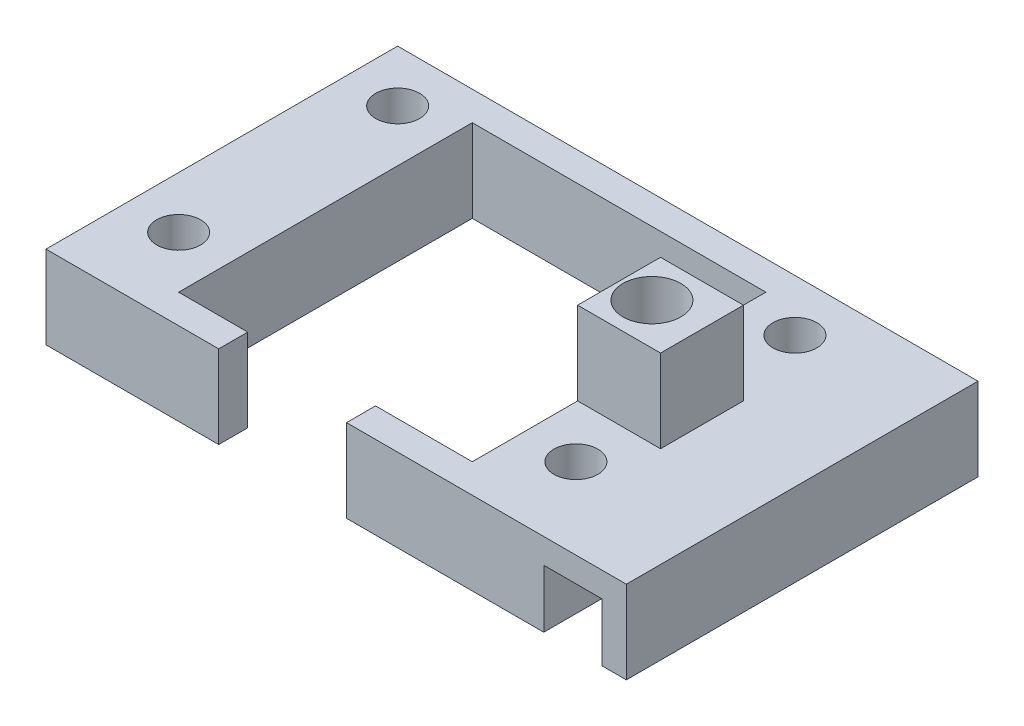
ISO-10303-21;
HEADER;
FILE_DESCRIPTION(('STEP AP214'),'2;1');
FILE_NAME('part.step','',(''),(''),'','','');
FILE_SCHEMA(('AUTOMOTIVE_DESIGN { 1 0 10303 214 1 1 1 1 }'));
ENDSEC;
DATA;
#1=APPLICATION_CONTEXT('core data for automotive mechanical design processes');
#2=APPLICATION_PROTOCOL_DEFINITION('international standard','automotive_design',2000,#1);
#3=PRODUCT_CONTEXT('',#1,'mechanical');
#4=PRODUCT('Part','Part','',(#3));
#5=PRODUCT_RELATED_PRODUCT_CATEGORY('part','',(#4));
#6=PRODUCT_DEFINITION_FORMATION('','',#4);
#7=PRODUCT_DEFINITION_CONTEXT('part definition',#1,'design');
#8=PRODUCT_DEFINITION('design','',#6,#7);
#9=PRODUCT_DEFINITION_SHAPE('','',#8);
#10=(LENGTH_UNIT() NAMED_UNIT(*) SI_UNIT(.MILLI.,.METRE.));
#11=(NAMED_UNIT(*) PLANE_ANGLE_UNIT() SI_UNIT($,.RADIAN.));
#12=(NAMED_UNIT(*) SI_UNIT($,.STERADIAN.) SOLID_ANGLE_UNIT());
#13=UNCERTAINTY_MEASURE_WITH_UNIT(LENGTH_MEASURE(1.E-05),#10,'distance_accuracy_value','');
#14=(GEOMETRIC_REPRESENTATION_CONTEXT(3) GLOBAL_UNCERTAINTY_ASSIGNED_CONTEXT((#13)) GLOBAL_UNIT_ASSIGNED_CONTEXT((#10,
#11,#12)) REPRESENTATION_CONTEXT('',''));
#15=CARTESIAN_POINT('',(0.,0.,0.));
#16=DIRECTION('',(0.,0.,1.));
#17=DIRECTION('',(1.,0.,0.));
#18=AXIS2_PLACEMENT_3D('',#15,#16,#17);
#19=CARTESIAN_POINT('',(42.5,12.,0.));
#20=DIRECTION('',(-1.,0.,0.));
#21=DIRECTION('',(0.,0.,1.));
#22=AXIS2_PLACEMENT_3D('',#19,#20,#21);
#23=PLANE('',#22);
#24=DIRECTION('',(0.,0.,-1.));
#25=VECTOR('',#24,1.);
#26=CARTESIAN_POINT('',(42.5,0.,0.));
#27=LINE('',#26,#25);
#28=CARTESIAN_POINT('',(42.5,0.,0.));
#29=VERTEX_POINT('',#28);
#30=CARTESIAN_POINT('',(42.5,0.,-42.5));
#31=VERTEX_POINT('',#30);
#32=EDGE_CURVE('E293',#29,#31,#27,.T.);
#33=ORIENTED_EDGE('',*,*,#32,.F.);
#34=DIRECTION('',(0.,-1.,0.));
#35=VECTOR('',#34,1.);
#36=CARTESIAN_POINT('',(42.5,12.,0.));
#37=LINE('',#36,#35);
#38=CARTESIAN_POINT('',(42.5,12.,0.));
#39=VERTEX_POINT('',#38);
#40=EDGE_CURVE('E11',#39,#29,#37,.T.);
#41=ORIENTED_EDGE('',*,*,#40,.F.);
#42=DIRECTION('',(0.,0.,-1.));
#43=VECTOR('',#42,1.);
#44=CARTESIAN_POINT('',(42.5,12.,0.));
#45=LINE('',#44,#43);
#46=CARTESIAN_POINT('',(42.5,12.,-15.25));
#47=VERTEX_POINT('',#46);
#48=EDGE_CURVE('E193',#39,#47,#45,.T.);
#49=ORIENTED_EDGE('',*,*,#48,.T.);
#50=DIRECTION('',(0.,-1.,0.));
#51=VECTOR('',#50,1.);
#52=CARTESIAN_POINT('',(42.5,24.,-15.25));
#53=LINE('',#52,#51);
#54=CARTESIAN_POINT('',(42.5,24.,-15.25));
#55=VERTEX_POINT('',#54);
#56=EDGE_CURVE('E173',#55,#47,#53,.T.);
#57=ORIENTED_EDGE('',*,*,#56,.F.);
#58=DIRECTION('',(0.,0.,1.));
#59=VECTOR('',#58,1.);
#60=CARTESIAN_POINT('',(42.5,24.,-27.25));
#61=LINE('',#60,#59);
#62=CARTESIAN_POINT('',(42.5,24.,-27.25));
#63=VERTEX_POINT('',#62);
#64=EDGE_CURVE('E179',#63,#55,#61,.T.);
#65=ORIENTED_EDGE('',*,*,#64,.F.);
#66=DIRECTION('',(0.,-1.,0.));
#67=VECTOR('',#66,1.);
#68=CARTESIAN_POINT('',(42.5,24.,-27.25));
#69=LINE('',#68,#67);
#70=CARTESIAN_POINT('',(42.5,12.,-27.25));
#71=VERTEX_POINT('',#70);
#72=EDGE_CURVE('E718',#63,#71,#69,.T.);
#73=ORIENTED_EDGE('',*,*,#72,.T.);
#74=CARTESIAN_POINT('',(42.5,12.,-42.5));
#75=VERTEX_POINT('',#74);
#76=EDGE_CURVE('E54',#71,#75,#45,.T.);
#77=ORIENTED_EDGE('',*,*,#76,.T.);
#78=DIRECTION('',(0.,-1.,0.));
#79=VECTOR('',#78,1.);
#80=CARTESIAN_POINT('',(42.5,12.,-42.5));
#81=LINE('',#80,#79);
#82=EDGE_CURVE('E281',#75,#31,#81,.T.);
#83=ORIENTED_EDGE('',*,*,#82,.T.);
#84=EDGE_LOOP('',(#33,#41,#49,#57,#65,#73,#77,#83));
#85=FACE_BOUND('',#84,.T.);
#86=ADVANCED_FACE('F34',(#85),#23,.T.);
#87=CARTESIAN_POINT('',(0.,12.,0.));
#88=DIRECTION('',(0.,0.,-1.));
#89=DIRECTION('',(-1.,0.,0.));
#90=AXIS2_PLACEMENT_3D('',#87,#88,#89);
#91=PLANE('',#90);
#92=DIRECTION('',(1.,0.,0.));
#93=VECTOR('',#92,1.);
#94=CARTESIAN_POINT('',(0.,0.,0.));
#95=LINE('',#94,#93);
#96=CARTESIAN_POINT('',(28.5,0.,0.));
#97=VERTEX_POINT('',#96);
#98=EDGE_CURVE('E296',#97,#29,#95,.T.);
#99=ORIENTED_EDGE('',*,*,#98,.F.);
#100=DIRECTION('',(0.,-1.,0.));
#101=VECTOR('',#100,1.);
#102=CARTESIAN_POINT('',(28.5,12.,0.));
#103=LINE('',#102,#101);
#104=CARTESIAN_POINT('',(28.5,12.,0.));
#105=VERTEX_POINT('',#104);
#106=EDGE_CURVE('E42',#105,#97,#103,.T.);
#107=ORIENTED_EDGE('',*,*,#106,.F.);
#108=DIRECTION('',(1.,0.,0.));
#109=VECTOR('',#108,1.);
#110=CARTESIAN_POINT('',(0.,12.,0.));
#111=LINE('',#110,#109);
#112=EDGE_CURVE('E255',#105,#39,#111,.T.);
#113=ORIENTED_EDGE('',*,*,#112,.T.);
#114=ORIENTED_EDGE('',*,*,#40,.T.);
#115=EDGE_LOOP('',(#99,#107,#113,#114));
#116=FACE_BOUND('',#115,.T.);
#117=ADVANCED_FACE('F349',(#116),#91,.T.);
#118=CARTESIAN_POINT('',(28.5,12.,0.));
#119=DIRECTION('',(1.,0.,0.));
#120=DIRECTION('',(0.,0.,-1.));
#121=AXIS2_PLACEMENT_3D('',#118,#119,#120);
#122=PLANE('',#121);
#123=DIRECTION('',(0.,0.,1.));
#124=VECTOR('',#123,1.);
#125=CARTESIAN_POINT('',(28.5,0.,0.));
#126=LINE('',#125,#124);
#127=CARTESIAN_POINT('',(28.5,0.,4.20000000000001));
#128=VERTEX_POINT('',#127);
#129=EDGE_CURVE('E299',#97,#128,#126,.T.);
#130=ORIENTED_EDGE('',*,*,#129,.T.);
#131=DIRECTION('',(0.,-1.,0.));
#132=VECTOR('',#131,1.);
#133=CARTESIAN_POINT('',(28.5,12.,4.20000000000001));
#134=LINE('',#133,#132);
#135=CARTESIAN_POINT('',(28.5,12.,4.20000000000001));
#136=VERTEX_POINT('',#135);
#137=EDGE_CURVE('E338',#136,#128,#134,.T.);
#138=ORIENTED_EDGE('',*,*,#137,.F.);
#139=DIRECTION('',(0.,0.,1.));
#140=VECTOR('',#139,1.);
#141=CARTESIAN_POINT('',(28.5,12.,0.));
#142=LINE('',#141,#140);
#143=EDGE_CURVE('E258',#105,#136,#142,.T.);
#144=ORIENTED_EDGE('',*,*,#143,.F.);
#145=ORIENTED_EDGE('',*,*,#106,.T.);
#146=EDGE_LOOP('',(#130,#138,#144,#145));
#147=FACE_BOUND('',#146,.T.);
#148=ADVANCED_FACE('F342',(#147),#122,.F.);
#149=CARTESIAN_POINT('',(0.,12.,4.20000000000001));
#150=DIRECTION('',(0.,0.,1.));
#151=DIRECTION('',(1.,0.,0.));
#152=AXIS2_PLACEMENT_3D('',#149,#150,#151);
#153=PLANE('',#152);
#154=DIRECTION('',(-1.,0.,0.));
#155=VECTOR('',#154,1.);
#156=CARTESIAN_POINT('',(0.,0.,4.20000000000001));
#157=LINE('',#156,#155);
#158=CARTESIAN_POINT('',(57.05,0.,4.20000000000001));
#159=VERTEX_POINT('',#158);
#160=EDGE_CURVE('E302',#159,#128,#157,.T.);
#161=ORIENTED_EDGE('',*,*,#160,.F.);
#162=DIRECTION('',(0.,1.,0.));
#163=VECTOR('',#162,1.);
#164=CARTESIAN_POINT('',(57.05,0.,4.20000000000001));
#165=LINE('',#164,#163);
#166=CARTESIAN_POINT('',(57.05,8.4,4.20000000000001));
#167=VERTEX_POINT('',#166);
#168=EDGE_CURVE('E206',#159,#167,#165,.T.);
#169=ORIENTED_EDGE('',*,*,#168,.T.);
#170=DIRECTION('',(-1.,0.,0.));
#171=VECTOR('',#170,1.);
#172=CARTESIAN_POINT('',(0.,8.4,4.20000000000001));
#173=LINE('',#172,#171);
#174=CARTESIAN_POINT('',(65.45,8.4,4.20000000000001));
#175=VERTEX_POINT('',#174);
#176=EDGE_CURVE('E212',#175,#167,#173,.T.);
#177=ORIENTED_EDGE('',*,*,#176,.F.);
#178=DIRECTION('',(0.,1.,0.));
#179=VECTOR('',#178,1.);
#180=CARTESIAN_POINT('',(65.45,0.,4.20000000000001));
#181=LINE('',#180,#179);
#182=CARTESIAN_POINT('',(65.45,0.,4.20000000000001));
#183=VERTEX_POINT('',#182);
#184=EDGE_CURVE('E207',#183,#175,#181,.T.);
#185=ORIENTED_EDGE('',*,*,#184,.F.);
#186=DIRECTION('',(-1.,0.,0.));
#187=VECTOR('',#186,1.);
#188=CARTESIAN_POINT('',(0.,0.,4.20000000000001));
#189=LINE('',#188,#187);
#190=CARTESIAN_POINT('',(69.,0.,4.20000000000001));
#191=VERTEX_POINT('',#190);
#192=EDGE_CURVE('E219',#191,#183,#189,.T.);
#193=ORIENTED_EDGE('',*,*,#192,.F.);
#194=DIRECTION('',(0.,1.,0.));
#195=VECTOR('',#194,1.);
#196=CARTESIAN_POINT('',(69.,0.,4.20000000000001));
#197=LINE('',#196,#195);
#198=CARTESIAN_POINT('',(69.,12.,4.20000000000001));
#199=VERTEX_POINT('',#198);
#200=EDGE_CURVE('E202',#191,#199,#197,.T.);
#201=ORIENTED_EDGE('',*,*,#200,.T.);
#202=DIRECTION('',(-1.,0.,0.));
#203=VECTOR('',#202,1.);
#204=CARTESIAN_POINT('',(0.,12.,4.20000000000001));
#205=LINE('',#204,#203);
#206=EDGE_CURVE('E260',#199,#136,#205,.T.);
#207=ORIENTED_EDGE('',*,*,#206,.T.);
#208=ORIENTED_EDGE('',*,*,#137,.T.);
#209=EDGE_LOOP('',(#161,#169,#177,#185,#193,#201,#207,#208));
#210=FACE_BOUND('',#209,.T.);
#211=ADVANCED_FACE('F387',(#210),#153,.T.);
#212=CARTESIAN_POINT('',(0.,12.,-46.7));
#213=DIRECTION('',(0.,0.,-1.));
#214=DIRECTION('',(-1.,0.,0.));
#215=AXIS2_PLACEMENT_3D('',#212,#213,#214);
#216=PLANE('',#215);
#217=DIRECTION('',(1.,0.,0.));
#218=VECTOR('',#217,1.);
#219=CARTESIAN_POINT('',(0.,0.,-46.7));
#220=LINE('',#219,#218);
#221=CARTESIAN_POINT('',(-15.,0.,-46.7));
#222=VERTEX_POINT('',#221);
#223=CARTESIAN_POINT('',(57.05,0.,-46.7));
#224=VERTEX_POINT('',#223);
#225=EDGE_CURVE('E305',#222,#224,#220,.T.);
#226=ORIENTED_EDGE('',*,*,#225,.F.);
#227=DIRECTION('',(0.,-1.,0.));
#228=VECTOR('',#227,1.);
#229=CARTESIAN_POINT('',(-15.,12.,-46.7));
#230=LINE('',#229,#228);
#231=CARTESIAN_POINT('',(-15.,12.,-46.7));
#232=VERTEX_POINT('',#231);
#233=EDGE_CURVE('E336',#232,#222,#230,.T.);
#234=ORIENTED_EDGE('',*,*,#233,.F.);
#235=DIRECTION('',(1.,0.,0.));
#236=VECTOR('',#235,1.);
#237=CARTESIAN_POINT('',(0.,12.,-46.7));
#238=LINE('',#237,#236);
#239=CARTESIAN_POINT('',(69.,12.,-46.7));
#240=VERTEX_POINT('',#239);
#241=EDGE_CURVE('E263',#232,#240,#238,.T.);
#242=ORIENTED_EDGE('',*,*,#241,.T.);
#243=DIRECTION('',(0.,1.,0.));
#244=VECTOR('',#243,1.);
#245=CARTESIAN_POINT('',(69.,0.,-46.7));
#246=LINE('',#245,#244);
#247=CARTESIAN_POINT('',(69.,0.,-46.7));
#248=VERTEX_POINT('',#247);
#249=EDGE_CURVE('E222',#248,#240,#246,.T.);
#250=ORIENTED_EDGE('',*,*,#249,.F.);
#251=DIRECTION('',(-1.,0.,0.));
#252=VECTOR('',#251,1.);
#253=CARTESIAN_POINT('',(0.,0.,-46.7));
#254=LINE('',#253,#252);
#255=CARTESIAN_POINT('',(65.45,0.,-46.7));
#256=VERTEX_POINT('',#255);
#257=EDGE_CURVE('E194',#248,#256,#254,.T.);
#258=ORIENTED_EDGE('',*,*,#257,.T.);
#259=DIRECTION('',(0.,1.,0.));
#260=VECTOR('',#259,1.);
#261=CARTESIAN_POINT('',(65.45,0.,-46.7));
#262=LINE('',#261,#260);
#263=CARTESIAN_POINT('',(65.45,8.4,-46.7));
#264=VERTEX_POINT('',#263);
#265=EDGE_CURVE('E196',#256,#264,#262,.T.);
#266=ORIENTED_EDGE('',*,*,#265,.T.);
#267=DIRECTION('',(-1.,0.,0.));
#268=VECTOR('',#267,1.);
#269=CARTESIAN_POINT('',(0.,8.4,-46.7));
#270=LINE('',#269,#268);
#271=CARTESIAN_POINT('',(57.05,8.4,-46.7));
#272=VERTEX_POINT('',#271);
#273=EDGE_CURVE('E218',#264,#272,#270,.T.);
#274=ORIENTED_EDGE('',*,*,#273,.T.);
#275=DIRECTION('',(0.,1.,0.));
#276=VECTOR('',#275,1.);
#277=CARTESIAN_POINT('',(57.05,0.,-46.7));
#278=LINE('',#277,#276);
#279=EDGE_CURVE('E205',#224,#272,#278,.T.);
#280=ORIENTED_EDGE('',*,*,#279,.F.);
#281=EDGE_LOOP('',(#226,#234,#242,#250,#258,#266,#274,#280));
#282=FACE_BOUND('',#281,.T.);
#283=ADVANCED_FACE('F380',(#282),#216,.T.);
#284=CARTESIAN_POINT('',(-15.,12.,0.));
#285=DIRECTION('',(-1.,0.,0.));
#286=DIRECTION('',(0.,0.,1.));
#287=AXIS2_PLACEMENT_3D('',#284,#285,#286);
#288=PLANE('',#287);
#289=DIRECTION('',(0.,0.,-1.));
#290=VECTOR('',#289,1.);
#291=CARTESIAN_POINT('',(-15.,0.,0.));
#292=LINE('',#291,#290);
#293=CARTESIAN_POINT('',(-15.,0.,4.2));
#294=VERTEX_POINT('',#293);
#295=EDGE_CURVE('E307',#294,#222,#292,.T.);
#296=ORIENTED_EDGE('',*,*,#295,.F.);
#297=DIRECTION('',(0.,-1.,0.));
#298=VECTOR('',#297,1.);
#299=CARTESIAN_POINT('',(-15.,12.,4.2));
#300=LINE('',#299,#298);
#301=CARTESIAN_POINT('',(-15.,12.,4.2));
#302=VERTEX_POINT('',#301);
#303=EDGE_CURVE('E334',#302,#294,#300,.T.);
#304=ORIENTED_EDGE('',*,*,#303,.F.);
#305=DIRECTION('',(0.,0.,-1.));
#306=VECTOR('',#305,1.);
#307=CARTESIAN_POINT('',(-15.,12.,0.));
#308=LINE('',#307,#306);
#309=EDGE_CURVE('E265',#302,#232,#308,.T.);
#310=ORIENTED_EDGE('',*,*,#309,.T.);
#311=ORIENTED_EDGE('',*,*,#233,.T.);
#312=EDGE_LOOP('',(#296,#304,#310,#311));
#313=FACE_BOUND('',#312,.T.);
#314=ADVANCED_FACE('F374',(#313),#288,.T.);
#315=CARTESIAN_POINT('',(0.,12.,4.2));
#316=DIRECTION('',(0.,0.,-1.));
#317=DIRECTION('',(-1.,0.,0.));
#318=AXIS2_PLACEMENT_3D('',#315,#316,#317);
#319=PLANE('',#318);
#320=DIRECTION('',(1.,0.,0.));
#321=VECTOR('',#320,1.);
#322=CARTESIAN_POINT('',(0.,0.,4.2));
#323=LINE('',#322,#321);
#324=CARTESIAN_POINT('',(10.,0.,4.2));
#325=VERTEX_POINT('',#324);
#326=EDGE_CURVE('E310',#294,#325,#323,.T.);
#327=ORIENTED_EDGE('',*,*,#326,.T.);
#328=DIRECTION('',(0.,-1.,0.));
#329=VECTOR('',#328,1.);
#330=CARTESIAN_POINT('',(10.,12.,4.2));
#331=LINE('',#330,#329);
#332=CARTESIAN_POINT('',(10.,12.,4.2));
#333=VERTEX_POINT('',#332);
#334=EDGE_CURVE('E332',#333,#325,#331,.T.);
#335=ORIENTED_EDGE('',*,*,#334,.F.);
#336=DIRECTION('',(1.,0.,0.));
#337=VECTOR('',#336,1.);
#338=CARTESIAN_POINT('',(0.,12.,4.2));
#339=LINE('',#338,#337);
#340=EDGE_CURVE('E268',#302,#333,#339,.T.);
#341=ORIENTED_EDGE('',*,*,#340,.F.);
#342=ORIENTED_EDGE('',*,*,#303,.T.);
#343=EDGE_LOOP('',(#327,#335,#341,#342));
#344=FACE_BOUND('',#343,.T.);
#345=ADVANCED_FACE('F371',(#344),#319,.F.);
#346=CARTESIAN_POINT('',(10.,12.,0.));
#347=DIRECTION('',(1.,0.,0.));
#348=DIRECTION('',(0.,0.,-1.));
#349=AXIS2_PLACEMENT_3D('',#346,#347,#348);
#350=PLANE('',#349);
#351=DIRECTION('',(0.,0.,1.));
#352=VECTOR('',#351,1.);
#353=CARTESIAN_POINT('',(10.,0.,0.));
#354=LINE('',#353,#352);
#355=CARTESIAN_POINT('',(10.,0.,0.));
#356=VERTEX_POINT('',#355);
#357=EDGE_CURVE('E313',#356,#325,#354,.T.);
#358=ORIENTED_EDGE('',*,*,#357,.F.);
#359=DIRECTION('',(0.,-1.,0.));
#360=VECTOR('',#359,1.);
#361=CARTESIAN_POINT('',(10.,12.,0.));
#362=LINE('',#361,#360);
#363=CARTESIAN_POINT('',(10.,12.,0.));
#364=VERTEX_POINT('',#363);
#365=EDGE_CURVE('E330',#364,#356,#362,.T.);
#366=ORIENTED_EDGE('',*,*,#365,.F.);
#367=DIRECTION('',(0.,0.,1.));
#368=VECTOR('',#367,1.);
#369=CARTESIAN_POINT('',(10.,12.,0.));
#370=LINE('',#369,#368);
#371=EDGE_CURVE('E270',#364,#333,#370,.T.);
#372=ORIENTED_EDGE('',*,*,#371,.T.);
#373=ORIENTED_EDGE('',*,*,#334,.T.);
#374=EDGE_LOOP('',(#358,#366,#372,#373));
#375=FACE_BOUND('',#374,.T.);
#376=ADVANCED_FACE('F366',(#375),#350,.T.);
#377=CARTESIAN_POINT('',(0.,12.,0.));
#378=DIRECTION('',(0.,0.,-1.));
#379=DIRECTION('',(-1.,0.,0.));
#380=AXIS2_PLACEMENT_3D('',#377,#378,#379);
#381=PLANE('',#380);
#382=DIRECTION('',(1.,0.,0.));
#383=VECTOR('',#382,1.);
#384=CARTESIAN_POINT('',(0.,0.,0.));
#385=LINE('',#384,#383);
#386=CARTESIAN_POINT('',(0.,0.,0.));
#387=VERTEX_POINT('',#386);
#388=EDGE_CURVE('E316',#387,#356,#385,.T.);
#389=ORIENTED_EDGE('',*,*,#388,.F.);
#390=DIRECTION('',(0.,-1.,0.));
#391=VECTOR('',#390,1.);
#392=CARTESIAN_POINT('',(0.,12.,0.));
#393=LINE('',#392,#391);
#394=CARTESIAN_POINT('',(0.,12.,0.));
#395=VERTEX_POINT('',#394);
#396=EDGE_CURVE('E328',#395,#387,#393,.T.);
#397=ORIENTED_EDGE('',*,*,#396,.F.);
#398=DIRECTION('',(1.,0.,0.));
#399=VECTOR('',#398,1.);
#400=CARTESIAN_POINT('',(0.,12.,0.));
#401=LINE('',#400,#399);
#402=EDGE_CURVE('E273',#395,#364,#401,.T.);
#403=ORIENTED_EDGE('',*,*,#402,.T.);
#404=ORIENTED_EDGE('',*,*,#365,.T.);
#405=EDGE_LOOP('',(#389,#397,#403,#404));
#406=FACE_BOUND('',#405,.T.);
#407=ADVANCED_FACE('F361',(#406),#381,.T.);
#408=CARTESIAN_POINT('',(0.,12.,0.));
#409=DIRECTION('',(-1.,0.,0.));
#410=DIRECTION('',(0.,0.,1.));
#411=AXIS2_PLACEMENT_3D('',#408,#409,#410);
#412=PLANE('',#411);
#413=DIRECTION('',(0.,0.,-1.));
#414=VECTOR('',#413,1.);
#415=CARTESIAN_POINT('',(0.,0.,0.));
#416=LINE('',#415,#414);
#417=CARTESIAN_POINT('',(0.,0.,-42.5));
#418=VERTEX_POINT('',#417);
#419=EDGE_CURVE('E319',#387,#418,#416,.T.);
#420=ORIENTED_EDGE('',*,*,#419,.T.);
#421=DIRECTION('',(0.,-1.,0.));
#422=VECTOR('',#421,1.);
#423=CARTESIAN_POINT('',(0.,12.,-42.5));
#424=LINE('',#423,#422);
#425=CARTESIAN_POINT('',(0.,12.,-42.5));
#426=VERTEX_POINT('',#425);
#427=EDGE_CURVE('E325',#426,#418,#424,.T.);
#428=ORIENTED_EDGE('',*,*,#427,.F.);
#429=DIRECTION('',(0.,0.,-1.));
#430=VECTOR('',#429,1.);
#431=CARTESIAN_POINT('',(0.,12.,0.));
#432=LINE('',#431,#430);
#433=EDGE_CURVE('E276',#395,#426,#432,.T.);
#434=ORIENTED_EDGE('',*,*,#433,.F.);
#435=ORIENTED_EDGE('',*,*,#396,.T.);
#436=EDGE_LOOP('',(#420,#428,#434,#435));
#437=FACE_BOUND('',#436,.T.);
#438=ADVANCED_FACE('F358',(#437),#412,.F.);
#439=CARTESIAN_POINT('',(-7.5,12.,-7.5));
#440=DIRECTION('',(0.,-1.,0.));
#441=DIRECTION('',(0.,0.,-1.));
#442=AXIS2_PLACEMENT_3D('',#439,#440,#441);
#443=CYLINDRICAL_SURFACE('',#442,3.175);
#444=CARTESIAN_POINT('',(-7.5,12.,-7.5));
#445=DIRECTION('',(0.,1.,0.));
#446=DIRECTION('',(0.,0.,1.));
#447=AXIS2_PLACEMENT_3D('',#444,#445,#446);
#448=CIRCLE('',#447,3.175);
#449=CARTESIAN_POINT('',(-7.5,12.,-4.325));
#450=VERTEX_POINT('',#449);
#451=EDGE_CURVE('E251',#450,#450,#448,.T.);
#452=ORIENTED_EDGE('',*,*,#451,.T.);
#453=EDGE_LOOP('',(#452));
#454=FACE_BOUND('',#453,.T.);
#455=CARTESIAN_POINT('',(-7.5,0.,-7.5));
#456=DIRECTION('',(0.,1.,0.));
#457=DIRECTION('',(0.,0.,1.));
#458=AXIS2_PLACEMENT_3D('',#455,#456,#457);
#459=CIRCLE('',#458,3.175);
#460=CARTESIAN_POINT('',(-7.5,0.,-4.325));
#461=VERTEX_POINT('',#460);
#462=EDGE_CURVE('E290',#461,#461,#459,.T.);
#463=ORIENTED_EDGE('',*,*,#462,.F.);
#464=EDGE_LOOP('',(#463));
#465=FACE_BOUND('',#464,.T.);
#466=ADVANCED_FACE('F424',(#454,#465),#443,.F.);
#467=CARTESIAN_POINT('',(50.,12.,-39.2));
#468=DIRECTION('',(0.,-1.,0.));
#469=DIRECTION('',(0.,0.,-1.));
#470=AXIS2_PLACEMENT_3D('',#467,#468,#469);
#471=CYLINDRICAL_SURFACE('',#470,3.175);
#472=CARTESIAN_POINT('',(50.,12.,-39.2));
#473=DIRECTION('',(0.,1.,0.));
#474=DIRECTION('',(0.,0.,1.));
#475=AXIS2_PLACEMENT_3D('',#472,#473,#474);
#476=CIRCLE('',#475,3.175);
#477=CARTESIAN_POINT('',(50.,12.,-36.025));
#478=VERTEX_POINT('',#477);
#479=EDGE_CURVE('E248',#478,#478,#476,.T.);
#480=ORIENTED_EDGE('',*,*,#479,.T.);
#481=EDGE_LOOP('',(#480));
#482=FACE_BOUND('',#481,.T.);
#483=CARTESIAN_POINT('',(50.,0.,-39.2));
#484=DIRECTION('',(0.,1.,0.));
#485=DIRECTION('',(0.,0.,1.));
#486=AXIS2_PLACEMENT_3D('',#483,#484,#485);
#487=CIRCLE('',#486,3.175);
#488=CARTESIAN_POINT('',(50.,0.,-36.025));
#489=VERTEX_POINT('',#488);
#490=EDGE_CURVE('E287',#489,#489,#487,.T.);
#491=ORIENTED_EDGE('',*,*,#490,.F.);
#492=EDGE_LOOP('',(#491));
#493=FACE_BOUND('',#492,.T.);
#494=ADVANCED_FACE('F427',(#482,#493),#471,.F.);
#495=CARTESIAN_POINT('',(50.,12.,-7.5));
#496=DIRECTION('',(0.,-1.,0.));
#497=DIRECTION('',(0.,0.,-1.));
#498=AXIS2_PLACEMENT_3D('',#495,#496,#497);
#499=CYLINDRICAL_SURFACE('',#498,3.175);
#500=CARTESIAN_POINT('',(50.,12.,-7.5));
#501=DIRECTION('',(0.,1.,0.));
#502=DIRECTION('',(0.,0.,1.));
#503=AXIS2_PLACEMENT_3D('',#500,#501,#502);
#504=CIRCLE('',#503,3.175);
#505=CARTESIAN_POINT('',(50.,12.,-4.325));
#506=VERTEX_POINT('',#505);
#507=EDGE_CURVE('E244',#506,#506,#504,.T.);
#508=ORIENTED_EDGE('',*,*,#507,.T.);
#509=EDGE_LOOP('',(#508));
#510=FACE_BOUND('',#509,.T.);
#511=CARTESIAN_POINT('',(50.,0.,-7.5));
#512=DIRECTION('',(0.,1.,0.));
#513=DIRECTION('',(0.,0.,1.));
#514=AXIS2_PLACEMENT_3D('',#511,#512,#513);
#515=CIRCLE('',#514,3.175);
#516=CARTESIAN_POINT('',(50.,0.,-4.325));
#517=VERTEX_POINT('',#516);
#518=EDGE_CURVE('E284',#517,#517,#515,.T.);
#519=ORIENTED_EDGE('',*,*,#518,.F.);
#520=EDGE_LOOP('',(#519));
#521=FACE_BOUND('',#520,.T.);
#522=ADVANCED_FACE('F430',(#510,#521),#499,.F.);
#523=CARTESIAN_POINT('',(-7.5,12.,-39.2));
#524=DIRECTION('',(0.,-1.,0.));
#525=DIRECTION('',(0.,0.,-1.));
#526=AXIS2_PLACEMENT_3D('',#523,#524,#525);
#527=CYLINDRICAL_SURFACE('',#526,3.175);
#528=CARTESIAN_POINT('',(-7.5,12.,-39.2));
#529=DIRECTION('',(0.,1.,0.));
#530=DIRECTION('',(0.,0.,1.));
#531=AXIS2_PLACEMENT_3D('',#528,#529,#530);
#532=CIRCLE('',#531,3.175);
#533=CARTESIAN_POINT('',(-7.5,12.,-36.025));
#534=VERTEX_POINT('',#533);
#535=EDGE_CURVE('E241',#534,#534,#532,.T.);
#536=ORIENTED_EDGE('',*,*,#535,.T.);
#537=EDGE_LOOP('',(#536));
#538=FACE_BOUND('',#537,.T.);
#539=CARTESIAN_POINT('',(-7.5,0.,-39.2));
#540=DIRECTION('',(0.,1.,0.));
#541=DIRECTION('',(0.,0.,1.));
#542=AXIS2_PLACEMENT_3D('',#539,#540,#541);
#543=CIRCLE('',#542,3.175);
#544=CARTESIAN_POINT('',(-7.5,0.,-36.025));
#545=VERTEX_POINT('',#544);
#546=EDGE_CURVE('E240',#545,#545,#543,.T.);
#547=ORIENTED_EDGE('',*,*,#546,.F.);
#548=EDGE_LOOP('',(#547));
#549=FACE_BOUND('',#548,.T.);
#550=ADVANCED_FACE('F36',(#538,#549),#527,.F.);
#551=CARTESIAN_POINT('',(0.,12.,-42.5));
#552=DIRECTION('',(0.,0.,-1.));
#553=DIRECTION('',(-1.,0.,0.));
#554=AXIS2_PLACEMENT_3D('',#551,#552,#553);
#555=PLANE('',#554);
#556=DIRECTION('',(1.,0.,0.));
#557=VECTOR('',#556,1.);
#558=CARTESIAN_POINT('',(0.,0.,-42.5));
#559=LINE('',#558,#557);
#560=EDGE_CURVE('E245',#418,#31,#559,.T.);
#561=ORIENTED_EDGE('',*,*,#560,.T.);
#562=ORIENTED_EDGE('',*,*,#82,.F.);
#563=DIRECTION('',(1.,0.,0.));
#564=VECTOR('',#563,1.);
#565=CARTESIAN_POINT('',(0.,12.,-42.5));
#566=LINE('',#565,#564);
#567=EDGE_CURVE('E279',#426,#75,#566,.T.);
#568=ORIENTED_EDGE('',*,*,#567,.F.);
#569=ORIENTED_EDGE('',*,*,#427,.T.);
#570=EDGE_LOOP('',(#561,#562,#568,#569));
#571=FACE_BOUND('',#570,.T.);
#572=ADVANCED_FACE('F355',(#571),#555,.F.);
#573=CARTESIAN_POINT('',(0.,12.,0.));
#574=DIRECTION('',(0.,1.,0.));
#575=DIRECTION('',(0.,0.,1.));
#576=AXIS2_PLACEMENT_3D('',#573,#574,#575);
#577=PLANE('',#576);
#578=DIRECTION('',(-1.,0.,0.));
#579=VECTOR('',#578,1.);
#580=CARTESIAN_POINT('',(42.5,12.,-27.25));
#581=LINE('',#580,#579);
#582=CARTESIAN_POINT('',(54.5,12.,-27.25));
#583=VERTEX_POINT('',#582);
#584=EDGE_CURVE('E49',#583,#71,#581,.T.);
#585=ORIENTED_EDGE('',*,*,#584,.F.);
#586=DIRECTION('',(0.,0.,-1.));
#587=VECTOR('',#586,1.);
#588=CARTESIAN_POINT('',(54.5,12.,-27.25));
#589=LINE('',#588,#587);
#590=CARTESIAN_POINT('',(54.5,12.,-15.25));
#591=VERTEX_POINT('',#590);
#592=EDGE_CURVE('E720',#591,#583,#589,.T.);
#593=ORIENTED_EDGE('',*,*,#592,.F.);
#594=DIRECTION('',(1.,0.,0.));
#595=VECTOR('',#594,1.);
#596=CARTESIAN_POINT('',(42.5,12.,-15.25));
#597=LINE('',#596,#595);
#598=EDGE_CURVE('E713',#47,#591,#597,.T.);
#599=ORIENTED_EDGE('',*,*,#598,.F.);
#600=ORIENTED_EDGE('',*,*,#48,.F.);
#601=ORIENTED_EDGE('',*,*,#112,.F.);
#602=ORIENTED_EDGE('',*,*,#143,.T.);
#603=ORIENTED_EDGE('',*,*,#206,.F.);
#604=DIRECTION('',(0.,0.,1.));
#605=VECTOR('',#604,1.);
#606=CARTESIAN_POINT('',(69.,12.,-66.3022957839127));
#607=LINE('',#606,#605);
#608=EDGE_CURVE('E227',#240,#199,#607,.T.);
#609=ORIENTED_EDGE('',*,*,#608,.F.);
#610=ORIENTED_EDGE('',*,*,#241,.F.);
#611=ORIENTED_EDGE('',*,*,#309,.F.);
#612=ORIENTED_EDGE('',*,*,#340,.T.);
#613=ORIENTED_EDGE('',*,*,#371,.F.);
#614=ORIENTED_EDGE('',*,*,#402,.F.);
#615=ORIENTED_EDGE('',*,*,#433,.T.);
#616=ORIENTED_EDGE('',*,*,#567,.T.);
#617=ORIENTED_EDGE('',*,*,#76,.F.);
#618=EDGE_LOOP('',(#585,#593,#599,#600,#601,#602,#603,#609,#610,#611,#612,#613,#614,#615,#616,#617));
#619=FACE_BOUND('',#618,.T.);
#620=ORIENTED_EDGE('',*,*,#535,.F.);
#621=EDGE_LOOP('',(#620));
#622=FACE_BOUND('',#621,.T.);
#623=ORIENTED_EDGE('',*,*,#507,.F.);
#624=EDGE_LOOP('',(#623));
#625=FACE_BOUND('',#624,.T.);
#626=ORIENTED_EDGE('',*,*,#479,.F.);
#627=EDGE_LOOP('',(#626));
#628=FACE_BOUND('',#627,.T.);
#629=ORIENTED_EDGE('',*,*,#451,.F.);
#630=EDGE_LOOP('',(#629));
#631=FACE_BOUND('',#630,.T.);
#632=ADVANCED_FACE('F392',(#619,#622,#625,#628,#631),#577,.T.);
#633=CARTESIAN_POINT('',(0.,0.,0.));
#634=DIRECTION('',(0.,1.,0.));
#635=DIRECTION('',(0.,0.,1.));
#636=AXIS2_PLACEMENT_3D('',#633,#634,#635);
#637=PLANE('',#636);
#638=ORIENTED_EDGE('',*,*,#546,.T.);
#639=EDGE_LOOP('',(#638));
#640=FACE_BOUND('',#639,.T.);
#641=ORIENTED_EDGE('',*,*,#518,.T.);
#642=EDGE_LOOP('',(#641));
#643=FACE_BOUND('',#642,.T.);
#644=ORIENTED_EDGE('',*,*,#490,.T.);
#645=EDGE_LOOP('',(#644));
#646=FACE_BOUND('',#645,.T.);
#647=ORIENTED_EDGE('',*,*,#462,.T.);
#648=EDGE_LOOP('',(#647));
#649=FACE_BOUND('',#648,.T.);
#650=ORIENTED_EDGE('',*,*,#32,.T.);
#651=ORIENTED_EDGE('',*,*,#560,.F.);
#652=ORIENTED_EDGE('',*,*,#419,.F.);
#653=ORIENTED_EDGE('',*,*,#388,.T.);
#654=ORIENTED_EDGE('',*,*,#357,.T.);
#655=ORIENTED_EDGE('',*,*,#326,.F.);
#656=ORIENTED_EDGE('',*,*,#295,.T.);
#657=ORIENTED_EDGE('',*,*,#225,.T.);
#658=DIRECTION('',(0.,0.,1.));
#659=VECTOR('',#658,1.);
#660=CARTESIAN_POINT('',(57.05,0.,-66.3022957839127));
#661=LINE('',#660,#659);
#662=EDGE_CURVE('E233',#224,#159,#661,.T.);
#663=ORIENTED_EDGE('',*,*,#662,.T.);
#664=ORIENTED_EDGE('',*,*,#160,.T.);
#665=ORIENTED_EDGE('',*,*,#129,.F.);
#666=ORIENTED_EDGE('',*,*,#98,.T.);
#667=EDGE_LOOP('',(#650,#651,#652,#653,#654,#655,#656,#657,#663,#664,#665,#666));
#668=FACE_BOUND('',#667,.T.);
#669=ADVANCED_FACE('F348',(#640,#643,#646,#649,#668),#637,.F.);
#670=CARTESIAN_POINT('',(57.05,0.,-66.3022957839127));
#671=DIRECTION('',(1.,0.,0.));
#672=DIRECTION('',(0.,0.,-1.));
#673=AXIS2_PLACEMENT_3D('',#670,#671,#672);
#674=PLANE('',#673);
#675=ORIENTED_EDGE('',*,*,#662,.F.);
#676=ORIENTED_EDGE('',*,*,#279,.T.);
#677=DIRECTION('',(0.,0.,1.));
#678=VECTOR('',#677,1.);
#679=CARTESIAN_POINT('',(57.05,8.4,-66.3022957839127));
#680=LINE('',#679,#678);
#681=EDGE_CURVE('E225',#272,#167,#680,.T.);
#682=ORIENTED_EDGE('',*,*,#681,.T.);
#683=ORIENTED_EDGE('',*,*,#168,.F.);
#684=EDGE_LOOP('',(#675,#676,#682,#683));
#685=FACE_BOUND('',#684,.T.);
#686=ADVANCED_FACE('F384',(#685),#674,.T.);
#687=CARTESIAN_POINT('',(0.,8.4,-66.3022957839127));
#688=DIRECTION('',(0.,1.,0.));
#689=DIRECTION('',(0.,0.,1.));
#690=AXIS2_PLACEMENT_3D('',#687,#688,#689);
#691=PLANE('',#690);
#692=ORIENTED_EDGE('',*,*,#273,.F.);
#693=DIRECTION('',(0.,0.,1.));
#694=VECTOR('',#693,1.);
#695=CARTESIAN_POINT('',(65.45,8.4,-66.3022957839127));
#696=LINE('',#695,#694);
#697=EDGE_CURVE('E215',#264,#175,#696,.T.);
#698=ORIENTED_EDGE('',*,*,#697,.T.);
#699=ORIENTED_EDGE('',*,*,#176,.T.);
#700=ORIENTED_EDGE('',*,*,#681,.F.);
#701=EDGE_LOOP('',(#692,#698,#699,#700));
#702=FACE_BOUND('',#701,.T.);
#703=ADVANCED_FACE('F407',(#702),#691,.F.);
#704=CARTESIAN_POINT('',(65.45,0.,-66.3022957839127));
#705=DIRECTION('',(1.,0.,0.));
#706=DIRECTION('',(0.,0.,-1.));
#707=AXIS2_PLACEMENT_3D('',#704,#705,#706);
#708=PLANE('',#707);
#709=ORIENTED_EDGE('',*,*,#265,.F.);
#710=DIRECTION('',(0.,0.,1.));
#711=VECTOR('',#710,1.);
#712=CARTESIAN_POINT('',(65.45,0.,-66.3022957839127));
#713=LINE('',#712,#711);
#714=EDGE_CURVE('E211',#256,#183,#713,.T.);
#715=ORIENTED_EDGE('',*,*,#714,.T.);
#716=ORIENTED_EDGE('',*,*,#184,.T.);
#717=ORIENTED_EDGE('',*,*,#697,.F.);
#718=EDGE_LOOP('',(#709,#715,#716,#717));
#719=FACE_BOUND('',#718,.T.);
#720=ADVANCED_FACE('F405',(#719),#708,.F.);
#721=CARTESIAN_POINT('',(0.,0.,-66.3022957839127));
#722=DIRECTION('',(0.,1.,0.));
#723=DIRECTION('',(0.,0.,1.));
#724=AXIS2_PLACEMENT_3D('',#721,#722,#723);
#725=PLANE('',#724);
#726=ORIENTED_EDGE('',*,*,#257,.F.);
#727=DIRECTION('',(0.,0.,1.));
#728=VECTOR('',#727,1.);
#729=CARTESIAN_POINT('',(69.,0.,-66.3022957839127));
#730=LINE('',#729,#728);
#731=EDGE_CURVE('E210',#248,#191,#730,.T.);
#732=ORIENTED_EDGE('',*,*,#731,.T.);
#733=ORIENTED_EDGE('',*,*,#192,.T.);
#734=ORIENTED_EDGE('',*,*,#714,.F.);
#735=EDGE_LOOP('',(#726,#732,#733,#734));
#736=FACE_BOUND('',#735,.T.);
#737=ADVANCED_FACE('F403',(#736),#725,.F.);
#738=CARTESIAN_POINT('',(69.,0.,-66.3022957839127));
#739=DIRECTION('',(1.,0.,0.));
#740=DIRECTION('',(0.,0.,-1.));
#741=AXIS2_PLACEMENT_3D('',#738,#739,#740);
#742=PLANE('',#741);
#743=ORIENTED_EDGE('',*,*,#731,.F.);
#744=ORIENTED_EDGE('',*,*,#249,.T.);
#745=ORIENTED_EDGE('',*,*,#608,.T.);
#746=ORIENTED_EDGE('',*,*,#200,.F.);
#747=EDGE_LOOP('',(#743,#744,#745,#746));
#748=FACE_BOUND('',#747,.T.);
#749=ADVANCED_FACE('F397',(#748),#742,.T.);
#750=CARTESIAN_POINT('',(0.,24.,0.));
#751=DIRECTION('',(0.,1.,0.));
#752=DIRECTION('',(0.,0.,1.));
#753=AXIS2_PLACEMENT_3D('',#750,#751,#752);
#754=PLANE('',#753);
#755=ORIENTED_EDGE('',*,*,#64,.T.);
#756=DIRECTION('',(1.,0.,0.));
#757=VECTOR('',#756,1.);
#758=CARTESIAN_POINT('',(42.5,24.,-15.25));
#759=LINE('',#758,#757);
#760=CARTESIAN_POINT('',(54.5,24.,-15.25));
#761=VERTEX_POINT('',#760);
#762=EDGE_CURVE('E168',#55,#761,#759,.T.);
#763=ORIENTED_EDGE('',*,*,#762,.T.);
#764=DIRECTION('',(0.,0.,-1.));
#765=VECTOR('',#764,1.);
#766=CARTESIAN_POINT('',(54.5,24.,-27.25));
#767=LINE('',#766,#765);
#768=CARTESIAN_POINT('',(54.5,24.,-27.25));
#769=VERTEX_POINT('',#768);
#770=EDGE_CURVE('E178',#761,#769,#767,.T.);
#771=ORIENTED_EDGE('',*,*,#770,.T.);
#772=DIRECTION('',(-1.,0.,0.));
#773=VECTOR('',#772,1.);
#774=CARTESIAN_POINT('',(42.5,24.,-27.25));
#775=LINE('',#774,#773);
#776=EDGE_CURVE('E185',#769,#63,#775,.T.);
#777=ORIENTED_EDGE('',*,*,#776,.T.);
#778=EDGE_LOOP('',(#755,#763,#771,#777));
#779=FACE_BOUND('',#778,.T.);
#780=CARTESIAN_POINT('',(47.25,24.,-21.25));
#781=DIRECTION('',(0.,1.,0.));
#782=DIRECTION('',(0.,0.,1.));
#783=AXIS2_PLACEMENT_3D('',#780,#781,#782);
#784=CIRCLE('',#783,4.2);
#785=CARTESIAN_POINT('',(47.25,24.,-17.05));
#786=VERTEX_POINT('',#785);
#787=EDGE_CURVE('E710',#786,#786,#784,.T.);
#788=ORIENTED_EDGE('',*,*,#787,.F.);
#789=EDGE_LOOP('',(#788));
#790=FACE_BOUND('',#789,.T.);
#791=ADVANCED_FACE('F182',(#779,#790),#754,.T.);
#792=CARTESIAN_POINT('',(42.5,24.,-15.25));
#793=DIRECTION('',(0.,0.,-1.));
#794=DIRECTION('',(-1.,0.,0.));
#795=AXIS2_PLACEMENT_3D('',#792,#793,#794);
#796=PLANE('',#795);
#797=ORIENTED_EDGE('',*,*,#598,.T.);
#798=DIRECTION('',(0.,-1.,0.));
#799=VECTOR('',#798,1.);
#800=CARTESIAN_POINT('',(54.5,24.,-15.25));
#801=LINE('',#800,#799);
#802=EDGE_CURVE('E175',#761,#591,#801,.T.);
#803=ORIENTED_EDGE('',*,*,#802,.F.);
#804=ORIENTED_EDGE('',*,*,#762,.F.);
#805=ORIENTED_EDGE('',*,*,#56,.T.);
#806=EDGE_LOOP('',(#797,#803,#804,#805));
#807=FACE_BOUND('',#806,.T.);
#808=ADVANCED_FACE('F171',(#807),#796,.F.);
#809=CARTESIAN_POINT('',(54.5,24.,-27.25));
#810=DIRECTION('',(-1.,0.,0.));
#811=DIRECTION('',(0.,0.,1.));
#812=AXIS2_PLACEMENT_3D('',#809,#810,#811);
#813=PLANE('',#812);
#814=ORIENTED_EDGE('',*,*,#592,.T.);
#815=DIRECTION('',(0.,-1.,0.));
#816=VECTOR('',#815,1.);
#817=CARTESIAN_POINT('',(54.5,24.,-27.25));
#818=LINE('',#817,#816);
#819=EDGE_CURVE('E198',#769,#583,#818,.T.);
#820=ORIENTED_EDGE('',*,*,#819,.F.);
#821=ORIENTED_EDGE('',*,*,#770,.F.);
#822=ORIENTED_EDGE('',*,*,#802,.T.);
#823=EDGE_LOOP('',(#814,#820,#821,#822));
#824=FACE_BOUND('',#823,.T.);
#825=ADVANCED_FACE('F559',(#824),#813,.F.);
#826=CARTESIAN_POINT('',(42.5,24.,-27.25));
#827=DIRECTION('',(0.,0.,1.));
#828=DIRECTION('',(1.,0.,0.));
#829=AXIS2_PLACEMENT_3D('',#826,#827,#828);
#830=PLANE('',#829);
#831=ORIENTED_EDGE('',*,*,#584,.T.);
#832=ORIENTED_EDGE('',*,*,#72,.F.);
#833=ORIENTED_EDGE('',*,*,#776,.F.);
#834=ORIENTED_EDGE('',*,*,#819,.T.);
#835=EDGE_LOOP('',(#831,#832,#833,#834));
#836=FACE_BOUND('',#835,.T.);
#837=ADVANCED_FACE('F568',(#836),#830,.F.);
#838=CARTESIAN_POINT('',(47.25,24.,-21.25));
#839=DIRECTION('',(0.,-1.,0.));
#840=DIRECTION('',(0.,0.,-1.));
#841=AXIS2_PLACEMENT_3D('',#838,#839,#840);
#842=CYLINDRICAL_SURFACE('',#841,4.2);
#843=ORIENTED_EDGE('',*,*,#787,.T.);
#844=EDGE_LOOP('',(#843));
#845=FACE_BOUND('',#844,.T.);
#846=CARTESIAN_POINT('',(47.25,12.,-21.25));
#847=DIRECTION('',(0.,1.,0.));
#848=DIRECTION('',(0.,0.,1.));
#849=AXIS2_PLACEMENT_3D('',#846,#847,#848);
#850=CIRCLE('',#849,4.2);
#851=CARTESIAN_POINT('',(47.25,12.,-17.05));
#852=VERTEX_POINT('',#851);
#853=EDGE_CURVE('E708',#852,#852,#850,.T.);
#854=ORIENTED_EDGE('',*,*,#853,.F.);
#855=EDGE_LOOP('',(#854));
#856=FACE_BOUND('',#855,.T.);
#857=ADVANCED_FACE('F578',(#845,#856),#842,.F.);
#858=ORIENTED_EDGE('',*,*,#853,.T.);
#859=EDGE_LOOP('',(#858));
#860=FACE_BOUND('',#859,.T.);
#861=ADVANCED_FACE('F455',(#860),#577,.T.);
#862=CLOSED_SHELL('',(#86,#117,#148,#211,#283,#314,#345,#376,#407,#438,#466,#494,#522,#550,#572,
#632,#669,#686,#703,#720,#737,#749,#791,#808,#825,#837,#857,#861));
#863=MANIFOLD_SOLID_BREP('B2',#862);
#864=ADVANCED_BREP_SHAPE_REPRESENTATION('',(#18,#863),#14);
#865=SHAPE_DEFINITION_REPRESENTATION(#9,#864);
ENDSEC;
END-ISO-10303-21;
